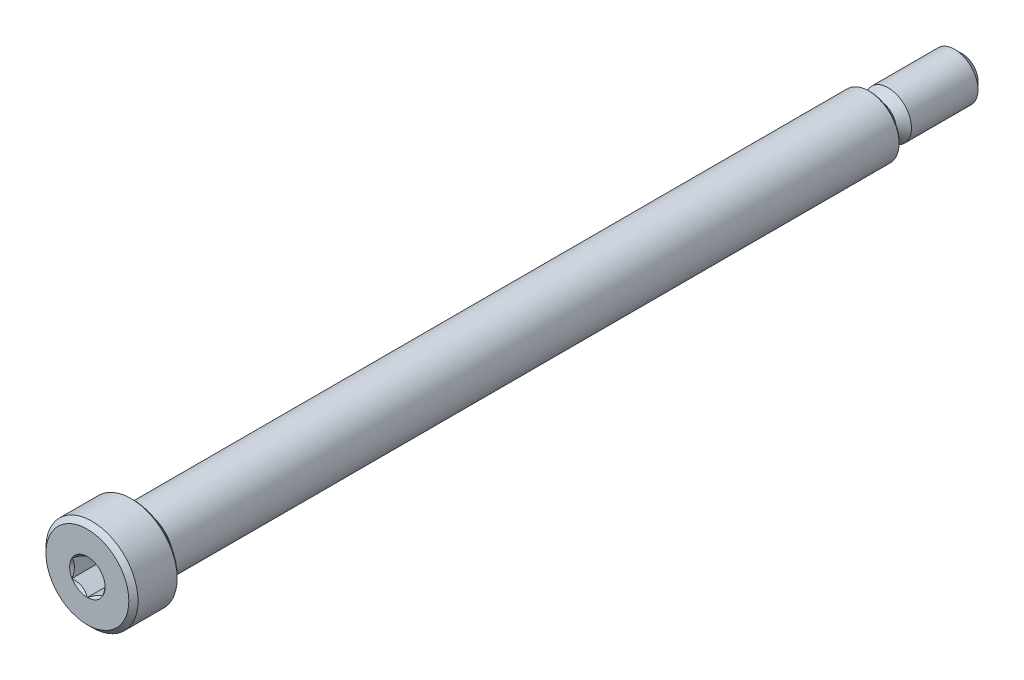
ISO-10303-21;
HEADER;
FILE_DESCRIPTION(('STEP AP214'),'2;1');
FILE_NAME('part.step','',(''),(''),'','','');
FILE_SCHEMA(('AUTOMOTIVE_DESIGN { 1 0 10303 214 1 1 1 1 }'));
ENDSEC;
DATA;
#1=APPLICATION_CONTEXT('core data for automotive mechanical design processes');
#2=APPLICATION_PROTOCOL_DEFINITION('international standard','automotive_design',2000,#1);
#3=PRODUCT_CONTEXT('',#1,'mechanical');
#4=PRODUCT('Part','Part','',(#3));
#5=PRODUCT_RELATED_PRODUCT_CATEGORY('part','',(#4));
#6=PRODUCT_DEFINITION_FORMATION('','',#4);
#7=PRODUCT_DEFINITION_CONTEXT('part definition',#1,'design');
#8=PRODUCT_DEFINITION('design','',#6,#7);
#9=PRODUCT_DEFINITION_SHAPE('','',#8);
#10=(LENGTH_UNIT() NAMED_UNIT(*) SI_UNIT(.MILLI.,.METRE.));
#11=(NAMED_UNIT(*) PLANE_ANGLE_UNIT() SI_UNIT($,.RADIAN.));
#12=(NAMED_UNIT(*) SI_UNIT($,.STERADIAN.) SOLID_ANGLE_UNIT());
#13=UNCERTAINTY_MEASURE_WITH_UNIT(LENGTH_MEASURE(1.E-05),#10,'distance_accuracy_value','');
#14=(GEOMETRIC_REPRESENTATION_CONTEXT(3) GLOBAL_UNCERTAINTY_ASSIGNED_CONTEXT((#13)) GLOBAL_UNIT_ASSIGNED_CONTEXT((#10,
#11,#12)) REPRESENTATION_CONTEXT('',''));
#15=CARTESIAN_POINT('',(0.,0.,0.));
#16=DIRECTION('',(0.,0.,1.));
#17=DIRECTION('',(1.,0.,0.));
#18=AXIS2_PLACEMENT_3D('',#15,#16,#17);
#19=CARTESIAN_POINT('',(0.,1.61924999999999,-45.24375));
#20=DIRECTION('',(0.,0.,1.));
#21=DIRECTION('',(1.,0.,0.));
#22=AXIS2_PLACEMENT_3D('',#19,#20,#21);
#23=PLANE('',#22);
#24=CARTESIAN_POINT('',(0.,0.,-45.24375));
#25=DIRECTION('',(0.,0.,1.));
#26=DIRECTION('',(1.,0.,0.));
#27=AXIS2_PLACEMENT_3D('',#24,#25,#26);
#28=CIRCLE('',#27,1.61924999999999);
#29=CARTESIAN_POINT('',(1.61924999999999,0.,-45.24375));
#30=VERTEX_POINT('',#29);
#31=EDGE_CURVE('E51',#30,#30,#28,.T.);
#32=ORIENTED_EDGE('',*,*,#31,.F.);
#33=EDGE_LOOP('',(#32));
#34=FACE_BOUND('',#33,.T.);
#35=ADVANCED_FACE('F38',(#34),#23,.F.);
#36=CARTESIAN_POINT('',(0.,0.,-45.24375));
#37=DIRECTION('',(0.,0.,1.));
#38=DIRECTION('',(1.,0.,0.));
#39=AXIS2_PLACEMENT_3D('',#36,#37,#38);
#40=CONICAL_SURFACE('',#39,1.61924999999999,0.785398163397446);
#41=CARTESIAN_POINT('',(0.,0.,-44.45));
#42=DIRECTION('',(0.,0.,1.));
#43=DIRECTION('',(1.,0.,0.));
#44=AXIS2_PLACEMENT_3D('',#41,#42,#43);
#45=CIRCLE('',#44,2.41299999999999);
#46=CARTESIAN_POINT('',(2.41299999999999,0.,-44.45));
#47=VERTEX_POINT('',#46);
#48=EDGE_CURVE('E210',#47,#47,#45,.T.);
#49=ORIENTED_EDGE('',*,*,#48,.F.);
#50=EDGE_LOOP('',(#49));
#51=FACE_BOUND('',#50,.T.);
#52=ORIENTED_EDGE('',*,*,#31,.T.);
#53=EDGE_LOOP('',(#52));
#54=FACE_BOUND('',#53,.T.);
#55=ADVANCED_FACE('F200',(#51,#54),#40,.T.);
#56=CARTESIAN_POINT('',(0.,0.,45.24375));
#57=DIRECTION('',(0.,0.,1.));
#58=DIRECTION('',(1.,0.,0.));
#59=AXIS2_PLACEMENT_3D('',#56,#57,#58);
#60=CYLINDRICAL_SURFACE('',#59,2.41299999999999);
#61=CARTESIAN_POINT('',(0.,0.,-37.5708333333333));
#62=DIRECTION('',(0.,0.,1.));
#63=DIRECTION('',(1.,0.,0.));
#64=AXIS2_PLACEMENT_3D('',#61,#62,#63);
#65=CIRCLE('',#64,2.41299999999999);
#66=CARTESIAN_POINT('',(2.41299999999999,0.,-37.5708333333333));
#67=VERTEX_POINT('',#66);
#68=EDGE_CURVE('E212',#67,#67,#65,.T.);
#69=ORIENTED_EDGE('',*,*,#68,.F.);
#70=EDGE_LOOP('',(#69));
#71=FACE_BOUND('',#70,.T.);
#72=ORIENTED_EDGE('',*,*,#48,.T.);
#73=EDGE_LOOP('',(#72));
#74=FACE_BOUND('',#73,.T.);
#75=ADVANCED_FACE('F205',(#71,#74),#60,.T.);
#76=CARTESIAN_POINT('',(0.,0.,-37.5708333333333));
#77=DIRECTION('',(0.,0.,-1.));
#78=DIRECTION('',(-1.,0.,0.));
#79=AXIS2_PLACEMENT_3D('',#76,#77,#78);
#80=CONICAL_SURFACE('',#79,2.41299999999999,0.785398163397448);
#81=CARTESIAN_POINT('',(0.,0.,-36.7770833333333));
#82=DIRECTION('',(0.,0.,1.));
#83=DIRECTION('',(1.,0.,0.));
#84=AXIS2_PLACEMENT_3D('',#81,#82,#83);
#85=CIRCLE('',#84,1.61924999999998);
#86=CARTESIAN_POINT('',(1.61924999999998,0.,-36.7770833333333));
#87=VERTEX_POINT('',#86);
#88=EDGE_CURVE('E217',#87,#87,#85,.T.);
#89=ORIENTED_EDGE('',*,*,#88,.F.);
#90=EDGE_LOOP('',(#89));
#91=FACE_BOUND('',#90,.T.);
#92=ORIENTED_EDGE('',*,*,#68,.T.);
#93=EDGE_LOOP('',(#92));
#94=FACE_BOUND('',#93,.T.);
#95=ADVANCED_FACE('F349',(#91,#94),#80,.T.);
#96=CARTESIAN_POINT('',(0.,0.,45.24375));
#97=DIRECTION('',(0.,0.,1.));
#98=DIRECTION('',(1.,0.,0.));
#99=AXIS2_PLACEMENT_3D('',#96,#97,#98);
#100=CYLINDRICAL_SURFACE('',#99,1.61924999999998);
#101=CARTESIAN_POINT('',(0.,0.,-36.115625));
#102=DIRECTION('',(0.,0.,1.));
#103=DIRECTION('',(1.,0.,0.));
#104=AXIS2_PLACEMENT_3D('',#101,#102,#103);
#105=CIRCLE('',#104,1.61924999999998);
#106=CARTESIAN_POINT('',(1.61924999999998,0.,-36.115625));
#107=VERTEX_POINT('',#106);
#108=EDGE_CURVE('E220',#107,#107,#105,.T.);
#109=ORIENTED_EDGE('',*,*,#108,.F.);
#110=EDGE_LOOP('',(#109));
#111=FACE_BOUND('',#110,.T.);
#112=ORIENTED_EDGE('',*,*,#88,.T.);
#113=EDGE_LOOP('',(#112));
#114=FACE_BOUND('',#113,.T.);
#115=ADVANCED_FACE('F345',(#111,#114),#100,.T.);
#116=CARTESIAN_POINT('',(0.,0.,-36.115625));
#117=DIRECTION('',(0.,0.,1.));
#118=DIRECTION('',(1.,0.,0.));
#119=AXIS2_PLACEMENT_3D('',#116,#117,#118);
#120=TOROIDAL_SURFACE('',#119,2.01612499999999,0.396875000000007);
#121=CARTESIAN_POINT('',(0.,0.,-35.71875));
#122=DIRECTION('',(0.,0.,1.));
#123=DIRECTION('',(1.,0.,0.));
#124=AXIS2_PLACEMENT_3D('',#121,#122,#123);
#125=CIRCLE('',#124,2.01612499999999);
#126=CARTESIAN_POINT('',(2.01612499999999,0.,-35.71875));
#127=VERTEX_POINT('',#126);
#128=EDGE_CURVE('E223',#127,#127,#125,.T.);
#129=ORIENTED_EDGE('',*,*,#128,.F.);
#130=EDGE_LOOP('',(#129));
#131=FACE_BOUND('',#130,.T.);
#132=ORIENTED_EDGE('',*,*,#108,.T.);
#133=EDGE_LOOP('',(#132));
#134=FACE_BOUND('',#133,.T.);
#135=ADVANCED_FACE('F341',(#131,#134),#120,.F.);
#136=CARTESIAN_POINT('',(0.,2.980055,-35.71875));
#137=DIRECTION('',(0.,0.,1.));
#138=DIRECTION('',(1.,0.,0.));
#139=AXIS2_PLACEMENT_3D('',#136,#137,#138);
#140=PLANE('',#139);
#141=CARTESIAN_POINT('',(0.,0.,-35.71875));
#142=DIRECTION('',(0.,0.,1.));
#143=DIRECTION('',(1.,0.,0.));
#144=AXIS2_PLACEMENT_3D('',#141,#142,#143);
#145=CIRCLE('',#144,2.98005499999999);
#146=CARTESIAN_POINT('',(2.98005499999999,0.,-35.71875));
#147=VERTEX_POINT('',#146);
#148=EDGE_CURVE('E226',#147,#147,#145,.T.);
#149=ORIENTED_EDGE('',*,*,#148,.F.);
#150=EDGE_LOOP('',(#149));
#151=FACE_BOUND('',#150,.T.);
#152=ORIENTED_EDGE('',*,*,#128,.T.);
#153=EDGE_LOOP('',(#152));
#154=FACE_BOUND('',#153,.T.);
#155=ADVANCED_FACE('F337',(#151,#154),#140,.F.);
#156=CARTESIAN_POINT('',(0.,0.,-35.71875));
#157=DIRECTION('',(0.,0.,1.));
#158=DIRECTION('',(1.,0.,0.));
#159=AXIS2_PLACEMENT_3D('',#156,#157,#158);
#160=CONICAL_SURFACE('',#159,2.98005499999999,0.785398163397394);
#161=CARTESIAN_POINT('',(0.,0.,-35.561905));
#162=DIRECTION('',(0.,0.,1.));
#163=DIRECTION('',(1.,0.,0.));
#164=AXIS2_PLACEMENT_3D('',#161,#162,#163);
#165=CIRCLE('',#164,3.13689999999999);
#166=CARTESIAN_POINT('',(3.13689999999999,0.,-35.561905));
#167=VERTEX_POINT('',#166);
#168=EDGE_CURVE('E229',#167,#167,#165,.T.);
#169=ORIENTED_EDGE('',*,*,#168,.F.);
#170=EDGE_LOOP('',(#169));
#171=FACE_BOUND('',#170,.T.);
#172=ORIENTED_EDGE('',*,*,#148,.T.);
#173=EDGE_LOOP('',(#172));
#174=FACE_BOUND('',#173,.T.);
#175=ADVANCED_FACE('F333',(#171,#174),#160,.T.);
#176=CARTESIAN_POINT('',(0.,0.,45.24375));
#177=DIRECTION('',(0.,0.,1.));
#178=DIRECTION('',(1.,0.,0.));
#179=AXIS2_PLACEMENT_3D('',#176,#177,#178);
#180=CYLINDRICAL_SURFACE('',#179,3.13689999999999);
#181=CARTESIAN_POINT('',(0.,0.,39.4229166666667));
#182=DIRECTION('',(0.,0.,1.));
#183=DIRECTION('',(1.,0.,0.));
#184=AXIS2_PLACEMENT_3D('',#181,#182,#183);
#185=CIRCLE('',#184,3.13689999999999);
#186=CARTESIAN_POINT('',(3.13689999999999,0.,39.4229166666667));
#187=VERTEX_POINT('',#186);
#188=EDGE_CURVE('E232',#187,#187,#185,.T.);
#189=ORIENTED_EDGE('',*,*,#188,.F.);
#190=EDGE_LOOP('',(#189));
#191=FACE_BOUND('',#190,.T.);
#192=ORIENTED_EDGE('',*,*,#168,.T.);
#193=EDGE_LOOP('',(#192));
#194=FACE_BOUND('',#193,.T.);
#195=ADVANCED_FACE('F329',(#191,#194),#180,.T.);
#196=CARTESIAN_POINT('',(0.,0.,39.4229166666667));
#197=DIRECTION('',(0.,0.,-1.));
#198=DIRECTION('',(-1.,0.,0.));
#199=AXIS2_PLACEMENT_3D('',#196,#197,#198);
#200=CONICAL_SURFACE('',#199,3.13689999999999,0.785398163397465);
#201=CARTESIAN_POINT('',(0.,0.,39.5797616666667));
#202=DIRECTION('',(0.,0.,1.));
#203=DIRECTION('',(1.,0.,0.));
#204=AXIS2_PLACEMENT_3D('',#201,#202,#203);
#205=CIRCLE('',#204,2.98005499999999);
#206=CARTESIAN_POINT('',(2.98005499999999,0.,39.5797616666667));
#207=VERTEX_POINT('',#206);
#208=EDGE_CURVE('E235',#207,#207,#205,.T.);
#209=ORIENTED_EDGE('',*,*,#208,.F.);
#210=EDGE_LOOP('',(#209));
#211=FACE_BOUND('',#210,.T.);
#212=ORIENTED_EDGE('',*,*,#188,.T.);
#213=EDGE_LOOP('',(#212));
#214=FACE_BOUND('',#213,.T.);
#215=ADVANCED_FACE('F325',(#211,#214),#200,.T.);
#216=CARTESIAN_POINT('',(0.,0.,45.24375));
#217=DIRECTION('',(0.,0.,1.));
#218=DIRECTION('',(1.,0.,0.));
#219=AXIS2_PLACEMENT_3D('',#216,#217,#218);
#220=CYLINDRICAL_SURFACE('',#219,2.98005499999999);
#221=CARTESIAN_POINT('',(0.,0.,40.36361625));
#222=DIRECTION('',(0.,0.,1.));
#223=DIRECTION('',(1.,0.,0.));
#224=AXIS2_PLACEMENT_3D('',#221,#222,#223);
#225=CIRCLE('',#224,2.98005499999999);
#226=CARTESIAN_POINT('',(2.98005499999999,0.,40.36361625));
#227=VERTEX_POINT('',#226);
#228=EDGE_CURVE('E238',#227,#227,#225,.T.);
#229=ORIENTED_EDGE('',*,*,#228,.F.);
#230=EDGE_LOOP('',(#229));
#231=FACE_BOUND('',#230,.T.);
#232=ORIENTED_EDGE('',*,*,#208,.T.);
#233=EDGE_LOOP('',(#232));
#234=FACE_BOUND('',#233,.T.);
#235=ADVANCED_FACE('F321',(#231,#234),#220,.T.);
#236=CARTESIAN_POINT('',(0.,0.,40.36361625));
#237=DIRECTION('',(0.,0.,1.));
#238=DIRECTION('',(1.,0.,0.));
#239=AXIS2_PLACEMENT_3D('',#236,#237,#238);
#240=TOROIDAL_SURFACE('',#239,3.09768874999999,0.117633750000003);
#241=CARTESIAN_POINT('',(0.,0.,40.48125));
#242=DIRECTION('',(0.,0.,1.));
#243=DIRECTION('',(1.,0.,0.));
#244=AXIS2_PLACEMENT_3D('',#241,#242,#243);
#245=CIRCLE('',#244,3.09768874999999);
#246=CARTESIAN_POINT('',(3.09768874999999,0.,40.48125));
#247=VERTEX_POINT('',#246);
#248=EDGE_CURVE('E241',#247,#247,#245,.T.);
#249=ORIENTED_EDGE('',*,*,#248,.F.);
#250=EDGE_LOOP('',(#249));
#251=FACE_BOUND('',#250,.T.);
#252=ORIENTED_EDGE('',*,*,#228,.T.);
#253=EDGE_LOOP('',(#252));
#254=FACE_BOUND('',#253,.T.);
#255=ADVANCED_FACE('F317',(#251,#254),#240,.F.);
#256=CARTESIAN_POINT('',(0.,4.524375,40.48125));
#257=DIRECTION('',(0.,0.,1.));
#258=DIRECTION('',(1.,0.,0.));
#259=AXIS2_PLACEMENT_3D('',#256,#257,#258);
#260=PLANE('',#259);
#261=CARTESIAN_POINT('',(0.,0.,40.48125));
#262=DIRECTION('',(0.,0.,1.));
#263=DIRECTION('',(1.,0.,0.));
#264=AXIS2_PLACEMENT_3D('',#261,#262,#263);
#265=CIRCLE('',#264,4.52437499999999);
#266=CARTESIAN_POINT('',(4.52437499999999,0.,40.48125));
#267=VERTEX_POINT('',#266);
#268=EDGE_CURVE('E244',#267,#267,#265,.T.);
#269=ORIENTED_EDGE('',*,*,#268,.F.);
#270=EDGE_LOOP('',(#269));
#271=FACE_BOUND('',#270,.T.);
#272=ORIENTED_EDGE('',*,*,#248,.T.);
#273=EDGE_LOOP('',(#272));
#274=FACE_BOUND('',#273,.T.);
#275=ADVANCED_FACE('F313',(#271,#274),#260,.F.);
#276=CARTESIAN_POINT('',(0.,0.,40.48125));
#277=DIRECTION('',(0.,0.,1.));
#278=DIRECTION('',(1.,0.,0.));
#279=AXIS2_PLACEMENT_3D('',#276,#277,#278);
#280=CONICAL_SURFACE('',#279,4.52437499999999,0.785398163397465);
#281=CARTESIAN_POINT('',(0.,0.,40.719375));
#282=DIRECTION('',(0.,0.,1.));
#283=DIRECTION('',(1.,0.,0.));
#284=AXIS2_PLACEMENT_3D('',#281,#282,#283);
#285=CIRCLE('',#284,4.76249999999999);
#286=CARTESIAN_POINT('',(4.76249999999999,0.,40.719375));
#287=VERTEX_POINT('',#286);
#288=EDGE_CURVE('E247',#287,#287,#285,.T.);
#289=ORIENTED_EDGE('',*,*,#288,.F.);
#290=EDGE_LOOP('',(#289));
#291=FACE_BOUND('',#290,.T.);
#292=ORIENTED_EDGE('',*,*,#268,.T.);
#293=EDGE_LOOP('',(#292));
#294=FACE_BOUND('',#293,.T.);
#295=ADVANCED_FACE('F309',(#291,#294),#280,.T.);
#296=CARTESIAN_POINT('',(0.,0.,45.24375));
#297=DIRECTION('',(0.,0.,1.));
#298=DIRECTION('',(1.,0.,0.));
#299=AXIS2_PLACEMENT_3D('',#296,#297,#298);
#300=CYLINDRICAL_SURFACE('',#299,4.76249999999999);
#301=CARTESIAN_POINT('',(0.,0.,44.7675));
#302=DIRECTION('',(0.,0.,1.));
#303=DIRECTION('',(1.,0.,0.));
#304=AXIS2_PLACEMENT_3D('',#301,#302,#303);
#305=CIRCLE('',#304,4.76249999999999);
#306=CARTESIAN_POINT('',(4.76249999999999,0.,44.7675));
#307=VERTEX_POINT('',#306);
#308=EDGE_CURVE('E250',#307,#307,#305,.T.);
#309=ORIENTED_EDGE('',*,*,#308,.F.);
#310=EDGE_LOOP('',(#309));
#311=FACE_BOUND('',#310,.T.);
#312=ORIENTED_EDGE('',*,*,#288,.T.);
#313=EDGE_LOOP('',(#312));
#314=FACE_BOUND('',#313,.T.);
#315=ADVANCED_FACE('F302',(#311,#314),#300,.T.);
#316=CARTESIAN_POINT('',(0.,0.,44.7675));
#317=DIRECTION('',(0.,0.,-1.));
#318=DIRECTION('',(-1.,0.,0.));
#319=AXIS2_PLACEMENT_3D('',#316,#317,#318);
#320=CONICAL_SURFACE('',#319,4.76249999999999,0.785398163397444);
#321=CARTESIAN_POINT('',(0.,0.,45.24375));
#322=DIRECTION('',(0.,0.,1.));
#323=DIRECTION('',(1.,0.,0.));
#324=AXIS2_PLACEMENT_3D('',#321,#322,#323);
#325=CIRCLE('',#324,4.28624999999999);
#326=CARTESIAN_POINT('',(4.28624999999999,0.,45.24375));
#327=VERTEX_POINT('',#326);
#328=EDGE_CURVE('E253',#327,#327,#325,.T.);
#329=ORIENTED_EDGE('',*,*,#328,.F.);
#330=EDGE_LOOP('',(#329));
#331=FACE_BOUND('',#330,.T.);
#332=ORIENTED_EDGE('',*,*,#308,.T.);
#333=EDGE_LOOP('',(#332));
#334=FACE_BOUND('',#333,.T.);
#335=ADVANCED_FACE('F297',(#331,#334),#320,.T.);
#336=CARTESIAN_POINT('',(0.,0.,45.24375));
#337=DIRECTION('',(0.,0.,-1.));
#338=DIRECTION('',(-1.,0.,0.));
#339=AXIS2_PLACEMENT_3D('',#336,#337,#338);
#340=PLANE('',#339);
#341=CARTESIAN_POINT('',(0.,0.,45.24375));
#342=DIRECTION('',(0.,0.,1.));
#343=DIRECTION('',(1.,0.,0.));
#344=AXIS2_PLACEMENT_3D('',#341,#342,#343);
#345=CIRCLE('',#344,1.83308710467706);
#346=CARTESIAN_POINT('',(-1.5875,0.916543552338531,45.24375));
#347=VERTEX_POINT('',#346);
#348=CARTESIAN_POINT('',(-1.5875,-0.916543552338529,45.24375));
#349=VERTEX_POINT('',#348);
#350=EDGE_CURVE('E97',#347,#349,#345,.T.);
#351=ORIENTED_EDGE('',*,*,#350,.F.);
#352=CARTESIAN_POINT('',(0.,1.83308710467706,45.24375));
#353=VERTEX_POINT('',#352);
#354=EDGE_CURVE('E106',#353,#347,#345,.T.);
#355=ORIENTED_EDGE('',*,*,#354,.F.);
#356=CARTESIAN_POINT('',(1.5875,0.916543552338537,45.24375));
#357=VERTEX_POINT('',#356);
#358=EDGE_CURVE('E57',#357,#353,#345,.T.);
#359=ORIENTED_EDGE('',*,*,#358,.F.);
#360=CARTESIAN_POINT('',(1.5875,-0.916543552338529,45.24375));
#361=VERTEX_POINT('',#360);
#362=EDGE_CURVE('E64',#361,#357,#345,.T.);
#363=ORIENTED_EDGE('',*,*,#362,.F.);
#364=CARTESIAN_POINT('',(0.,-1.83308710467706,45.24375));
#365=VERTEX_POINT('',#364);
#366=EDGE_CURVE('E135',#365,#361,#345,.T.);
#367=ORIENTED_EDGE('',*,*,#366,.F.);
#368=EDGE_CURVE('E107',#349,#365,#345,.T.);
#369=ORIENTED_EDGE('',*,*,#368,.F.);
#370=EDGE_LOOP('',(#351,#355,#359,#363,#367,#369));
#371=FACE_BOUND('',#370,.T.);
#372=ORIENTED_EDGE('',*,*,#328,.T.);
#373=EDGE_LOOP('',(#372));
#374=FACE_BOUND('',#373,.T.);
#375=ADVANCED_FACE('F133',(#371,#374),#340,.F.);
#376=CARTESIAN_POINT('',(0.,0.,45.24375));
#377=DIRECTION('',(0.,0.,1.));
#378=DIRECTION('',(1.,0.,0.));
#379=AXIS2_PLACEMENT_3D('',#376,#377,#378);
#380=CONICAL_SURFACE('',#379,1.83308710467706,0.78539816339745);
#381=ORIENTED_EDGE('',*,*,#368,.T.);
#382=CARTESIAN_POINT('',(-1.5877,-0.916428082284692,45.2438654809637));
#383=CARTESIAN_POINT('',(-1.53312479190087,-0.947937093371808,45.2123808083706));
#384=CARTESIAN_POINT('',(-1.47763696320971,-0.979973006203393,45.1827450460135));
#385=CARTESIAN_POINT('',(-1.36449087915364,-1.04529792829092,45.1284822600208));
#386=CARTESIAN_POINT('',(-1.30682185887062,-1.07859315267522,45.1038854351332));
#387=CARTESIAN_POINT('',(-1.1905349781269,-1.14573141457583,45.0617503642726));
#388=CARTESIAN_POINT('',(-1.13194674474407,-1.17955734689075,45.0441061927298));
#389=CARTESIAN_POINT('',(-1.01348022674557,-1.24795402294714,45.016921470085));
#390=CARTESIAN_POINT('',(-0.953605562983896,-1.28252267618758,45.0073606206951));
#391=CARTESIAN_POINT('',(-0.850418771876558,-1.34209759781022,44.998734413104));
#392=CARTESIAN_POINT('',(-0.807240015952288,-1.36702686416637,44.9974571928096));
#393=CARTESIAN_POINT('',(-0.720953038535398,-1.41684467380557,44.9996070558147));
#394=CARTESIAN_POINT('',(-0.677844847078611,-1.44173319974743,45.0030357885493));
#395=CARTESIAN_POINT('',(-0.59204633500203,-1.49126899379091,45.0144009944333));
#396=CARTESIAN_POINT('',(-0.549356408925406,-1.51591603410293,45.0223413718016));
#397=CARTESIAN_POINT('',(-0.464693063478358,-1.56479643938728,45.0422984144511));
#398=CARTESIAN_POINT('',(-0.422719959755075,-1.58902962212064,45.0543168292087));
#399=CARTESIAN_POINT('',(-0.315211458113566,-1.65109968448354,45.0899968972472));
#400=CARTESIAN_POINT('',(-0.2503427717089,-1.68855163804125,45.1163485723031));
#401=CARTESIAN_POINT('',(-0.154961599380923,-1.74361998356043,45.1608335368517));
#402=CARTESIAN_POINT('',(-0.123530699536155,-1.76176662204668,45.1764628578011));
#403=CARTESIAN_POINT('',(-0.0612469855696353,-1.79772614107138,45.2091484878611));
#404=CARTESIAN_POINT('',(-0.0303939039605752,-1.8155391760437,45.226204115657));
#405=CARTESIAN_POINT('',(0.000200000000000565,-1.8332025747309,45.2438654809637));
#406=B_SPLINE_CURVE_WITH_KNOTS('',3,(#382,#383,#384,#385,#386,#387,#388,#389,#390,#391,#392,
#393,#394,#395,#396,#397,#398,#399,#400,#401,#402,#403,#404,#405),.UNSPECIFIED.,.F.,.F.,(4,2,2,
2,2,2,2,2,2,2,2,4),(0.,0.211482650810815,0.424197870807276,0.633533884524816,0.84234265326335,
0.991755553727144,1.14122083674205,1.29081565918878,1.44047473906438,1.6781878086972,
1.79671410024895,1.91518409436632),.UNSPECIFIED.);
#407=EDGE_CURVE('E11',#349,#365,#406,.T.);
#408=ORIENTED_EDGE('',*,*,#407,.F.);
#409=EDGE_LOOP('',(#381,#408));
#410=FACE_BOUND('',#409,.T.);
#411=ADVANCED_FACE('F111',(#410),#380,.F.);
#412=ORIENTED_EDGE('',*,*,#366,.T.);
#413=CARTESIAN_POINT('',(-0.000200000000001966,-1.8332025747309,45.2438654809637));
#414=CARTESIAN_POINT('',(0.0543752080991335,-1.80169356364378,45.2123808083706));
#415=CARTESIAN_POINT('',(0.109863036790287,-1.7696576508122,45.1827450460135));
#416=CARTESIAN_POINT('',(0.223009120846356,-1.70433272872468,45.1284822600208));
#417=CARTESIAN_POINT('',(0.28067814112938,-1.67103750434037,45.1038854351332));
#418=CARTESIAN_POINT('',(0.396965021873103,-1.60389924243976,45.0617503642726));
#419=CARTESIAN_POINT('',(0.455553255255931,-1.57007331012484,45.0441061927298));
#420=CARTESIAN_POINT('',(0.574019773254431,-1.50167663406845,45.016921470085));
#421=CARTESIAN_POINT('',(0.633894437016106,-1.46710798082801,45.0073606206951));
#422=CARTESIAN_POINT('',(0.737081228123444,-1.40753305920537,44.998734413104));
#423=CARTESIAN_POINT('',(0.780259984047714,-1.38260379284922,44.9974571928096));
#424=CARTESIAN_POINT('',(0.866546961464604,-1.33278598321002,44.9996070558147));
#425=CARTESIAN_POINT('',(0.90965515292139,-1.30789745726817,45.0030357885493));
#426=CARTESIAN_POINT('',(0.995453664997972,-1.25836166322468,45.0144009944333));
#427=CARTESIAN_POINT('',(1.0381435910746,-1.23371462291266,45.0223413718016));
#428=CARTESIAN_POINT('',(1.12280693652164,-1.18483421762831,45.0422984144511));
#429=CARTESIAN_POINT('',(1.16478004024493,-1.16060103489495,45.0543168292087));
#430=CARTESIAN_POINT('',(1.27228854188644,-1.09853097253205,45.0899968972472));
#431=CARTESIAN_POINT('',(1.3371572282911,-1.06107901897434,45.1163485723031));
#432=CARTESIAN_POINT('',(1.43253840061908,-1.00601067345516,45.1608335368517));
#433=CARTESIAN_POINT('',(1.46396930046384,-0.987864034968915,45.1764628578011));
#434=CARTESIAN_POINT('',(1.52625301443036,-0.951904515944215,45.2091484878611));
#435=CARTESIAN_POINT('',(1.55710609603942,-0.934091480971895,45.226204115657));
#436=CARTESIAN_POINT('',(1.5877,-0.916428082284694,45.2438654809637));
#437=B_SPLINE_CURVE_WITH_KNOTS('',3,(#413,#414,#415,#416,#417,#418,#419,#420,#421,#422,#423,
#424,#425,#426,#427,#428,#429,#430,#431,#432,#433,#434,#435,#436),.UNSPECIFIED.,.F.,.F.,(4,2,2,
2,2,2,2,2,2,2,2,4),(0.,0.211482650810815,0.424197870807278,0.633533884524818,0.842342653263353,
0.991755553727146,1.14122083674205,1.29081565918878,1.44047473906438,1.6781878086972,
1.79671410024894,1.91518409436631),.UNSPECIFIED.);
#438=EDGE_CURVE('E137',#365,#361,#437,.T.);
#439=ORIENTED_EDGE('',*,*,#438,.F.);
#440=EDGE_LOOP('',(#412,#439));
#441=FACE_BOUND('',#440,.T.);
#442=ADVANCED_FACE('F287',(#441),#380,.F.);
#443=ORIENTED_EDGE('',*,*,#362,.T.);
#444=CARTESIAN_POINT('',(1.5875,-1.82796193752854,45.831737263254));
#445=CARTESIAN_POINT('',(1.5875,-1.78345227640908,45.7981366526755));
#446=CARTESIAN_POINT('',(1.5875,-1.73869460884114,45.7648654952982));
#447=CARTESIAN_POINT('',(1.5875,-1.64858256619968,45.6991181178338));
#448=CARTESIAN_POINT('',(1.5875,-1.60322804415397,45.6666420993982));
#449=CARTESIAN_POINT('',(1.5875,-1.46545441997287,45.5701476121245));
#450=CARTESIAN_POINT('',(1.5875,-1.37200191361453,45.5075801635837));
#451=CARTESIAN_POINT('',(1.5875,-1.17603565005265,45.384752804527));
#452=CARTESIAN_POINT('',(1.5875,-1.0733091548238,45.324828449735));
#453=CARTESIAN_POINT('',(1.5875,-0.862725191180891,45.2152140327188));
#454=CARTESIAN_POINT('',(1.5875,-0.754886591703735,45.1654894689971));
#455=CARTESIAN_POINT('',(1.5875,-0.593019911876899,45.1046560741112));
#456=CARTESIAN_POINT('',(1.5875,-0.541388282021832,45.0871964520654));
#457=CARTESIAN_POINT('',(1.5875,-0.436878539726308,45.0564223678696));
#458=CARTESIAN_POINT('',(1.5875,-0.384000341684467,45.0431081912829));
#459=CARTESIAN_POINT('',(1.5875,-0.27819692428028,45.0215383054896));
#460=CARTESIAN_POINT('',(1.5875,-0.225289653887532,45.0131959280048));
#461=CARTESIAN_POINT('',(1.5875,-0.118909299564334,45.0017325177097));
#462=CARTESIAN_POINT('',(1.5875,-0.0654363144870855,44.9986105873603));
#463=CARTESIAN_POINT('',(1.5875,0.0396125416393617,44.9978196410889));
#464=CARTESIAN_POINT('',(1.5875,0.0911870234776875,44.9999573430076));
#465=CARTESIAN_POINT('',(1.5875,0.193894008986133,45.009141368464));
#466=CARTESIAN_POINT('',(1.5875,0.245026469231597,45.0161881688511));
#467=CARTESIAN_POINT('',(1.5875,0.347344844708745,45.0349252166609));
#468=CARTESIAN_POINT('',(1.5875,0.398516068757362,45.0466944835388));
#469=CARTESIAN_POINT('',(1.5875,0.499740445944843,45.074250946481));
#470=CARTESIAN_POINT('',(1.5875,0.549793692255948,45.0900378063498));
#471=CARTESIAN_POINT('',(1.5875,0.707380773963354,45.1456797782163));
#472=CARTESIAN_POINT('',(1.5875,0.812671633972065,45.1918718624579));
#473=CARTESIAN_POINT('',(1.5875,1.01830702525798,45.2945743357707));
#474=CARTESIAN_POINT('',(1.5875,1.11863208590429,45.3511217953494));
#475=CARTESIAN_POINT('',(1.5875,1.31036772781771,45.4677841931104));
#476=CARTESIAN_POINT('',(1.5875,1.40197355431623,45.5275822157843));
#477=CARTESIAN_POINT('',(1.5875,1.53693633901999,45.6200238021751));
#478=CARTESIAN_POINT('',(1.5875,1.58134147295664,45.651163627594));
#479=CARTESIAN_POINT('',(1.5875,1.66954488801523,45.7142668194013));
#480=CARTESIAN_POINT('',(1.5875,1.71334333266279,45.7462299569622));
#481=CARTESIAN_POINT('',(1.5875,1.75688919183915,45.7785344886322));
#482=B_SPLINE_CURVE_WITH_KNOTS('',3,(#444,#445,#446,#447,#448,#449,#450,#451,#452,#453,#454,
#455,#456,#457,#458,#459,#460,#461,#462,#463,#464,#465,#466,#467,#468,#469,#470,#471,#472,#473,
#474,#475,#476,#477,#478,#479,#480,#481),.UNSPECIFIED.,.F.,.F.,(4,2,2,2,2,2,2,2,2,2,2,2,2,2,2,2,
2,2,4),(0.,0.167300856038504,0.334643709948955,0.671883358487458,1.0283722463923,
1.38363464368218,1.54700775551669,1.71039211899208,1.8708380735955,2.03125644026828,
2.18586834465335,2.34049526948591,2.49782525419329,2.65514207772673,2.99906299923215,
3.34424006214766,3.67226428551494,3.83496498281156,3.99762093763057),.UNSPECIFIED.);
#483=EDGE_CURVE('E145',#361,#357,#482,.T.);
#484=ORIENTED_EDGE('',*,*,#483,.F.);
#485=EDGE_LOOP('',(#443,#484));
#486=FACE_BOUND('',#485,.T.);
#487=ADVANCED_FACE('F284',(#486),#380,.F.);
#488=ORIENTED_EDGE('',*,*,#358,.T.);
#489=CARTESIAN_POINT('',(1.5877,0.916428082284694,45.2438654809637));
#490=CARTESIAN_POINT('',(1.53312479190086,0.94793709337181,45.2123808083706));
#491=CARTESIAN_POINT('',(1.47763696320971,0.979973006203395,45.1827450460135));
#492=CARTESIAN_POINT('',(1.36449087915364,1.04529792829092,45.1284822600208));
#493=CARTESIAN_POINT('',(1.30682185887062,1.07859315267522,45.1038854351332));
#494=CARTESIAN_POINT('',(1.1905349781269,1.14573141457583,45.0617503642726));
#495=CARTESIAN_POINT('',(1.13194674474407,1.17955734689075,45.0441061927298));
#496=CARTESIAN_POINT('',(1.01348022674557,1.24795402294714,45.016921470085));
#497=CARTESIAN_POINT('',(0.953605562983897,1.28252267618758,45.0073606206951));
#498=CARTESIAN_POINT('',(0.850418771876561,1.34209759781022,44.998734413104));
#499=CARTESIAN_POINT('',(0.807240015952291,1.36702686416637,44.9974571928096));
#500=CARTESIAN_POINT('',(0.720953038535402,1.41684467380557,44.9996070558147));
#501=CARTESIAN_POINT('',(0.677844847078616,1.44173319974742,45.0030357885493));
#502=CARTESIAN_POINT('',(0.592046335002035,1.49126899379091,45.0144009944333));
#503=CARTESIAN_POINT('',(0.549356408925411,1.51591603410293,45.0223413718016));
#504=CARTESIAN_POINT('',(0.464693063478364,1.56479643938728,45.0422984144511));
#505=CARTESIAN_POINT('',(0.422719959755079,1.58902962212064,45.0543168292087));
#506=CARTESIAN_POINT('',(0.31521145811357,1.65109968448354,45.0899968972472));
#507=CARTESIAN_POINT('',(0.250342771708904,1.68855163804125,45.1163485723031));
#508=CARTESIAN_POINT('',(0.154961599380926,1.74361998356043,45.1608335368517));
#509=CARTESIAN_POINT('',(0.123530699536157,1.76176662204668,45.1764628578011));
#510=CARTESIAN_POINT('',(0.0612469855696363,1.79772614107138,45.2091484878611));
#511=CARTESIAN_POINT('',(0.0303939039605764,1.8155391760437,45.226204115657));
#512=CARTESIAN_POINT('',(-0.000199999999999389,1.8332025747309,45.2438654809637));
#513=B_SPLINE_CURVE_WITH_KNOTS('',3,(#489,#490,#491,#492,#493,#494,#495,#496,#497,#498,#499,
#500,#501,#502,#503,#504,#505,#506,#507,#508,#509,#510,#511,#512),.UNSPECIFIED.,.F.,.F.,(4,2,2,
2,2,2,2,2,2,2,2,4),(0.,0.211482650810812,0.42419787080727,0.633533884524812,0.84234265326334,
0.991755553727133,1.14122083674204,1.29081565918876,1.44047473906437,1.67818780869719,
1.79671410024894,1.9151840943663),.UNSPECIFIED.);
#514=EDGE_CURVE('E165',#357,#353,#513,.T.);
#515=ORIENTED_EDGE('',*,*,#514,.F.);
#516=EDGE_LOOP('',(#488,#515));
#517=FACE_BOUND('',#516,.T.);
#518=ADVANCED_FACE('F293',(#517),#380,.F.);
#519=ORIENTED_EDGE('',*,*,#354,.T.);
#520=CARTESIAN_POINT('',(0.000200000000000722,1.8332025747309,45.2438654809637));
#521=CARTESIAN_POINT('',(-0.0543752080991344,1.80169356364378,45.2123808083706));
#522=CARTESIAN_POINT('',(-0.109863036790287,1.7696576508122,45.1827450460135));
#523=CARTESIAN_POINT('',(-0.223009120846357,1.70433272872468,45.1284822600208));
#524=CARTESIAN_POINT('',(-0.28067814112938,1.67103750434037,45.1038854351332));
#525=CARTESIAN_POINT('',(-0.396965021873102,1.60389924243976,45.0617503642726));
#526=CARTESIAN_POINT('',(-0.45555325525593,1.57007331012484,45.0441061927298));
#527=CARTESIAN_POINT('',(-0.574019773254429,1.50167663406845,45.016921470085));
#528=CARTESIAN_POINT('',(-0.633894437016104,1.46710798082801,45.0073606206951));
#529=CARTESIAN_POINT('',(-0.737081228123442,1.40753305920537,44.998734413104));
#530=CARTESIAN_POINT('',(-0.780259984047712,1.38260379284922,44.9974571928096));
#531=CARTESIAN_POINT('',(-0.866546961464601,1.33278598321002,44.9996070558147));
#532=CARTESIAN_POINT('',(-0.909655152921388,1.30789745726817,45.0030357885493));
#533=CARTESIAN_POINT('',(-0.99545366499797,1.25836166322468,45.0144009944333));
#534=CARTESIAN_POINT('',(-1.03814359107459,1.23371462291266,45.0223413718016));
#535=CARTESIAN_POINT('',(-1.12280693652164,1.18483421762831,45.0422984144511));
#536=CARTESIAN_POINT('',(-1.16478004024493,1.16060103489495,45.0543168292087));
#537=CARTESIAN_POINT('',(-1.27228854188643,1.09853097253205,45.0899968972472));
#538=CARTESIAN_POINT('',(-1.3371572282911,1.06107901897434,45.1163485723031));
#539=CARTESIAN_POINT('',(-1.43253840061908,1.00601067345516,45.1608335368517));
#540=CARTESIAN_POINT('',(-1.46396930046385,0.987864034968913,45.1764628578011));
#541=CARTESIAN_POINT('',(-1.52625301443037,0.951904515944213,45.2091484878611));
#542=CARTESIAN_POINT('',(-1.55710609603943,0.934091480971893,45.226204115657));
#543=CARTESIAN_POINT('',(-1.5877,0.916428082284693,45.2438654809637));
#544=B_SPLINE_CURVE_WITH_KNOTS('',3,(#520,#521,#522,#523,#524,#525,#526,#527,#528,#529,#530,
#531,#532,#533,#534,#535,#536,#537,#538,#539,#540,#541,#542,#543),.UNSPECIFIED.,.F.,.F.,(4,2,2,
2,2,2,2,2,2,2,2,4),(0.,0.211482650810815,0.424197870807276,0.633533884524816,0.842342653263349,
0.991755553727142,1.14122083674205,1.29081565918878,1.44047473906438,1.6781878086972,
1.79671410024894,1.91518409436631),.UNSPECIFIED.);
#545=EDGE_CURVE('E123',#353,#347,#544,.T.);
#546=ORIENTED_EDGE('',*,*,#545,.F.);
#547=EDGE_LOOP('',(#519,#546));
#548=FACE_BOUND('',#547,.T.);
#549=ADVANCED_FACE('F158',(#548),#380,.F.);
#550=ORIENTED_EDGE('',*,*,#350,.T.);
#551=CARTESIAN_POINT('',(-1.5875,-1.82796193726258,45.8317372630532));
#552=CARTESIAN_POINT('',(-1.5875,-1.78345227615059,45.7981366524824));
#553=CARTESIAN_POINT('',(-1.5875,-1.73869460859013,45.7648654951128));
#554=CARTESIAN_POINT('',(-1.5875,-1.64858256596372,45.6991181176639));
#555=CARTESIAN_POINT('',(-1.5875,-1.60322804392557,45.6666420992359));
#556=CARTESIAN_POINT('',(-1.5875,-1.46545441976761,45.5701476119854));
#557=CARTESIAN_POINT('',(-1.5875,-1.372001913425,45.50758016346));
#558=CARTESIAN_POINT('',(-1.5875,-1.17603564989744,45.384752804435));
#559=CARTESIAN_POINT('',(-1.5875,-1.07330915468727,45.3248284496591));
#560=CARTESIAN_POINT('',(-1.5875,-0.862725191083299,45.2152140326728));
#561=CARTESIAN_POINT('',(-1.5875,-0.754886591626392,45.1654894689649));
#562=CARTESIAN_POINT('',(-1.5875,-0.593019911814792,45.1046560740893));
#563=CARTESIAN_POINT('',(-1.5875,-0.541388281953344,45.0871964520431));
#564=CARTESIAN_POINT('',(-1.5875,-0.436878539644851,45.0564223678477));
#565=CARTESIAN_POINT('',(-1.5875,-0.384000341596421,45.043108191262));
#566=CARTESIAN_POINT('',(-1.5875,-0.278196924179274,45.021538305472));
#567=CARTESIAN_POINT('',(-1.5875,-0.225289653780159,45.0131959279895));
#568=CARTESIAN_POINT('',(-1.5875,-0.118909299444437,45.0017325177005));
#569=CARTESIAN_POINT('',(-1.5875,-0.0654363143610332,44.9986105873549));
#570=CARTESIAN_POINT('',(-1.5875,0.0396125417767708,44.9978196410921));
#571=CARTESIAN_POINT('',(-1.5875,0.0911870236203141,44.9999573430156));
#572=CARTESIAN_POINT('',(-1.5875,0.193894009138673,45.0091413684824));
#573=CARTESIAN_POINT('',(-1.5875,0.245026469388833,45.0161881688749));
#574=CARTESIAN_POINT('',(-1.5875,0.347344844875252,45.0349252166964));
#575=CARTESIAN_POINT('',(-1.5875,0.39851606892843,45.0466944835804));
#576=CARTESIAN_POINT('',(-1.5875,0.499740446124591,45.0742509465349));
#577=CARTESIAN_POINT('',(-1.5875,0.549793692439816,45.09003780641));
#578=CARTESIAN_POINT('',(-1.5875,0.707380774187262,45.1456797783058));
#579=CARTESIAN_POINT('',(-1.5875,0.812671634229888,45.1918718625745));
#580=CARTESIAN_POINT('',(-1.5875,1.01830702558102,45.2945743359444));
#581=CARTESIAN_POINT('',(-1.5875,1.11863208625862,45.3511217955531));
#582=CARTESIAN_POINT('',(-1.5875,1.31036772822831,45.4677841933715));
#583=CARTESIAN_POINT('',(-1.5875,1.40197355475199,45.5275822160727));
#584=CARTESIAN_POINT('',(-1.5875,1.53693633949296,45.6200238025041));
#585=CARTESIAN_POINT('',(-1.5875,1.58134147344183,45.6511636279364));
#586=CARTESIAN_POINT('',(-1.5875,1.66954488852479,45.7142668197706));
#587=CARTESIAN_POINT('',(-1.5875,1.7133433331845,45.7462299573449));
#588=CARTESIAN_POINT('',(-1.5875,1.75688919237298,45.7785344890283));
#589=B_SPLINE_CURVE_WITH_KNOTS('',3,(#551,#552,#553,#554,#555,#556,#557,#558,#559,#560,#561,
#562,#563,#564,#565,#566,#567,#568,#569,#570,#571,#572,#573,#574,#575,#576,#577,#578,#579,#580,
#581,#582,#583,#584,#585,#586,#587,#588),.UNSPECIFIED.,.F.,.F.,(4,2,2,2,2,2,2,2,2,2,2,2,2,2,2,2,
2,2,4),(0.,0.167300856006662,0.334643709885255,0.671883358358865,1.02837224619093,
1.38363464340873,1.54700775526169,1.7103921187555,1.87083807337658,2.03125644006703,
2.18586834446827,2.34049526931701,2.49782525404182,2.65514207759268,2.9990629992233,
3.34424006226482,3.67226428573993,3.83496498308973,3.99762093796191),.UNSPECIFIED.);
#590=EDGE_CURVE('E101',#347,#349,#589,.F.);
#591=ORIENTED_EDGE('',*,*,#590,.F.);
#592=EDGE_LOOP('',(#550,#591));
#593=FACE_BOUND('',#592,.T.);
#594=ADVANCED_FACE('F99',(#593),#380,.F.);
#595=CARTESIAN_POINT('',(0.,0.,42.148125));
#596=DIRECTION('',(0.,0.,1.));
#597=DIRECTION('',(1.,0.,0.));
#598=AXIS2_PLACEMENT_3D('',#595,#596,#597);
#599=PLANE('',#598);
#600=DIRECTION('',(0.,-1.,0.));
#601=VECTOR('',#600,1.);
#602=CARTESIAN_POINT('',(-1.5875,0.916543552338531,42.148125));
#603=LINE('',#602,#601);
#604=CARTESIAN_POINT('',(-1.5875,0.916543552338531,42.148125));
#605=VERTEX_POINT('',#604);
#606=CARTESIAN_POINT('',(-1.5875,-0.916543552338531,42.148125));
#607=VERTEX_POINT('',#606);
#608=EDGE_CURVE('E122',#605,#607,#603,.T.);
#609=ORIENTED_EDGE('',*,*,#608,.T.);
#610=DIRECTION('',(0.866025403784439,-0.5,0.));
#611=VECTOR('',#610,1.);
#612=CARTESIAN_POINT('',(-1.5875,-0.916543552338531,42.148125));
#613=LINE('',#612,#611);
#614=CARTESIAN_POINT('',(0.,-1.83308710467706,42.148125));
#615=VERTEX_POINT('',#614);
#616=EDGE_CURVE('E127',#607,#615,#613,.T.);
#617=ORIENTED_EDGE('',*,*,#616,.T.);
#618=DIRECTION('',(0.866025403784439,0.5,0.));
#619=VECTOR('',#618,1.);
#620=CARTESIAN_POINT('',(0.,-1.83308710467706,42.148125));
#621=LINE('',#620,#619);
#622=CARTESIAN_POINT('',(1.5875,-0.916543552338531,42.148125));
#623=VERTEX_POINT('',#622);
#624=EDGE_CURVE('E274',#615,#623,#621,.T.);
#625=ORIENTED_EDGE('',*,*,#624,.T.);
#626=DIRECTION('',(0.,1.,0.));
#627=VECTOR('',#626,1.);
#628=CARTESIAN_POINT('',(1.5875,-0.916543552338531,42.148125));
#629=LINE('',#628,#627);
#630=CARTESIAN_POINT('',(1.5875,0.916543552338531,42.148125));
#631=VERTEX_POINT('',#630);
#632=EDGE_CURVE('E271',#623,#631,#629,.T.);
#633=ORIENTED_EDGE('',*,*,#632,.T.);
#634=DIRECTION('',(-0.866025403784439,0.5,0.));
#635=VECTOR('',#634,1.);
#636=CARTESIAN_POINT('',(1.5875,0.916543552338531,42.148125));
#637=LINE('',#636,#635);
#638=CARTESIAN_POINT('',(0.,1.83308710467706,42.148125));
#639=VERTEX_POINT('',#638);
#640=EDGE_CURVE('E268',#631,#639,#637,.T.);
#641=ORIENTED_EDGE('',*,*,#640,.T.);
#642=DIRECTION('',(-0.866025403784439,-0.5,0.));
#643=VECTOR('',#642,1.);
#644=CARTESIAN_POINT('',(0.,1.83308710467706,42.148125));
#645=LINE('',#644,#643);
#646=EDGE_CURVE('E130',#639,#605,#645,.T.);
#647=ORIENTED_EDGE('',*,*,#646,.T.);
#648=EDGE_LOOP('',(#609,#617,#625,#633,#641,#647));
#649=FACE_BOUND('',#648,.T.);
#650=ADVANCED_FACE('F157',(#649),#599,.T.);
#651=CARTESIAN_POINT('',(-1.5875,-0.916543552338531,42.148125));
#652=DIRECTION('',(-0.5,-0.866025403784439,0.));
#653=DIRECTION('',(0.866025403784439,-0.5,0.));
#654=AXIS2_PLACEMENT_3D('',#651,#652,#653);
#655=PLANE('',#654);
#656=DIRECTION('',(0.,0.,1.));
#657=VECTOR('',#656,1.);
#658=CARTESIAN_POINT('',(-1.5875,-0.916543552338531,42.148125));
#659=LINE('',#658,#657);
#660=EDGE_CURVE('E118',#607,#349,#659,.T.);
#661=ORIENTED_EDGE('',*,*,#660,.T.);
#662=ORIENTED_EDGE('',*,*,#407,.T.);
#663=DIRECTION('',(0.,0.,1.));
#664=VECTOR('',#663,1.);
#665=CARTESIAN_POINT('',(0.,-1.83308710467706,42.148125));
#666=LINE('',#665,#664);
#667=EDGE_CURVE('E129',#615,#365,#666,.T.);
#668=ORIENTED_EDGE('',*,*,#667,.F.);
#669=ORIENTED_EDGE('',*,*,#616,.F.);
#670=EDGE_LOOP('',(#661,#662,#668,#669));
#671=FACE_BOUND('',#670,.T.);
#672=ADVANCED_FACE('F125',(#671),#655,.F.);
#673=CARTESIAN_POINT('',(0.,-1.83308710467706,42.148125));
#674=DIRECTION('',(0.5,-0.866025403784439,0.));
#675=DIRECTION('',(0.866025403784439,0.5,0.));
#676=AXIS2_PLACEMENT_3D('',#673,#674,#675);
#677=PLANE('',#676);
#678=ORIENTED_EDGE('',*,*,#667,.T.);
#679=ORIENTED_EDGE('',*,*,#438,.T.);
#680=DIRECTION('',(0.,0.,1.));
#681=VECTOR('',#680,1.);
#682=CARTESIAN_POINT('',(1.5875,-0.916543552338531,42.148125));
#683=LINE('',#682,#681);
#684=EDGE_CURVE('E257',#623,#361,#683,.T.);
#685=ORIENTED_EDGE('',*,*,#684,.F.);
#686=ORIENTED_EDGE('',*,*,#624,.F.);
#687=EDGE_LOOP('',(#678,#679,#685,#686));
#688=FACE_BOUND('',#687,.T.);
#689=ADVANCED_FACE('F152',(#688),#677,.F.);
#690=CARTESIAN_POINT('',(1.5875,-0.916543552338531,42.148125));
#691=DIRECTION('',(1.,0.,0.));
#692=DIRECTION('',(0.,1.,0.));
#693=AXIS2_PLACEMENT_3D('',#690,#691,#692);
#694=PLANE('',#693);
#695=ORIENTED_EDGE('',*,*,#684,.T.);
#696=ORIENTED_EDGE('',*,*,#483,.T.);
#697=DIRECTION('',(0.,0.,1.));
#698=VECTOR('',#697,1.);
#699=CARTESIAN_POINT('',(1.5875,0.916543552338531,42.148125));
#700=LINE('',#699,#698);
#701=EDGE_CURVE('E259',#631,#357,#700,.T.);
#702=ORIENTED_EDGE('',*,*,#701,.F.);
#703=ORIENTED_EDGE('',*,*,#632,.F.);
#704=EDGE_LOOP('',(#695,#696,#702,#703));
#705=FACE_BOUND('',#704,.T.);
#706=ADVANCED_FACE('F189',(#705),#694,.F.);
#707=CARTESIAN_POINT('',(1.5875,0.916543552338531,42.148125));
#708=DIRECTION('',(0.5,0.866025403784439,0.));
#709=DIRECTION('',(-0.866025403784439,0.5,0.));
#710=AXIS2_PLACEMENT_3D('',#707,#708,#709);
#711=PLANE('',#710);
#712=ORIENTED_EDGE('',*,*,#701,.T.);
#713=ORIENTED_EDGE('',*,*,#514,.T.);
#714=DIRECTION('',(0.,0.,1.));
#715=VECTOR('',#714,1.);
#716=CARTESIAN_POINT('',(0.,1.83308710467706,42.148125));
#717=LINE('',#716,#715);
#718=EDGE_CURVE('E262',#639,#353,#717,.T.);
#719=ORIENTED_EDGE('',*,*,#718,.F.);
#720=ORIENTED_EDGE('',*,*,#640,.F.);
#721=EDGE_LOOP('',(#712,#713,#719,#720));
#722=FACE_BOUND('',#721,.T.);
#723=ADVANCED_FACE('F185',(#722),#711,.F.);
#724=CARTESIAN_POINT('',(0.,1.83308710467706,42.148125));
#725=DIRECTION('',(-0.5,0.866025403784439,0.));
#726=DIRECTION('',(-0.866025403784439,-0.5,0.));
#727=AXIS2_PLACEMENT_3D('',#724,#725,#726);
#728=PLANE('',#727);
#729=ORIENTED_EDGE('',*,*,#718,.T.);
#730=ORIENTED_EDGE('',*,*,#545,.T.);
#731=DIRECTION('',(0.,0.,1.));
#732=VECTOR('',#731,1.);
#733=CARTESIAN_POINT('',(-1.5875,0.916543552338531,42.148125));
#734=LINE('',#733,#732);
#735=EDGE_CURVE('E120',#605,#347,#734,.T.);
#736=ORIENTED_EDGE('',*,*,#735,.F.);
#737=ORIENTED_EDGE('',*,*,#646,.F.);
#738=EDGE_LOOP('',(#729,#730,#736,#737));
#739=FACE_BOUND('',#738,.T.);
#740=ADVANCED_FACE('F182',(#739),#728,.F.);
#741=CARTESIAN_POINT('',(-1.5875,0.916543552338531,42.148125));
#742=DIRECTION('',(-1.,0.,0.));
#743=DIRECTION('',(0.,0.,1.));
#744=AXIS2_PLACEMENT_3D('',#741,#742,#743);
#745=PLANE('',#744);
#746=ORIENTED_EDGE('',*,*,#735,.T.);
#747=ORIENTED_EDGE('',*,*,#590,.T.);
#748=ORIENTED_EDGE('',*,*,#660,.F.);
#749=ORIENTED_EDGE('',*,*,#608,.F.);
#750=EDGE_LOOP('',(#746,#747,#748,#749));
#751=FACE_BOUND('',#750,.T.);
#752=ADVANCED_FACE('F116',(#751),#745,.F.);
#753=CLOSED_SHELL('',(#35,#55,#75,#95,#115,#135,#155,#175,#195,#215,#235,#255,#275,#295,#315,
#335,#375,#411,#442,#487,#518,#549,#594,#650,#672,#689,#706,#723,#740,#752));
#754=MANIFOLD_SOLID_BREP('B2',#753);
#755=ADVANCED_BREP_SHAPE_REPRESENTATION('',(#18,#754),#14);
#756=SHAPE_DEFINITION_REPRESENTATION(#9,#755);
ENDSEC;
END-ISO-10303-21;
